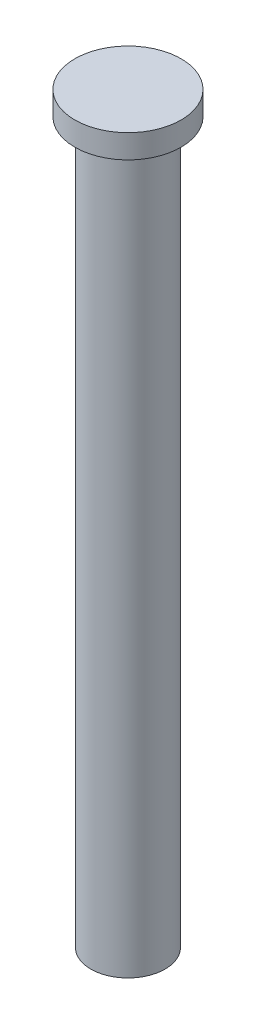
ISO-10303-21;
HEADER;
FILE_DESCRIPTION(('STEP AP214'),'2;1');
FILE_NAME('part.step','',(''),(''),'','','');
FILE_SCHEMA(('AUTOMOTIVE_DESIGN { 1 0 10303 214 1 1 1 1 }'));
ENDSEC;
DATA;
#1=APPLICATION_CONTEXT('core data for automotive mechanical design processes');
#2=APPLICATION_PROTOCOL_DEFINITION('international standard','automotive_design',2000,#1);
#3=PRODUCT_CONTEXT('',#1,'mechanical');
#4=PRODUCT('Part','Part','',(#3));
#5=PRODUCT_RELATED_PRODUCT_CATEGORY('part','',(#4));
#6=PRODUCT_DEFINITION_FORMATION('','',#4);
#7=PRODUCT_DEFINITION_CONTEXT('part definition',#1,'design');
#8=PRODUCT_DEFINITION('design','',#6,#7);
#9=PRODUCT_DEFINITION_SHAPE('','',#8);
#10=(LENGTH_UNIT() NAMED_UNIT(*) SI_UNIT(.MILLI.,.METRE.));
#11=(NAMED_UNIT(*) PLANE_ANGLE_UNIT() SI_UNIT($,.RADIAN.));
#12=(NAMED_UNIT(*) SI_UNIT($,.STERADIAN.) SOLID_ANGLE_UNIT());
#13=UNCERTAINTY_MEASURE_WITH_UNIT(LENGTH_MEASURE(1.E-05),#10,'distance_accuracy_value','');
#14=(GEOMETRIC_REPRESENTATION_CONTEXT(3) GLOBAL_UNCERTAINTY_ASSIGNED_CONTEXT((#13)) GLOBAL_UNIT_ASSIGNED_CONTEXT((#10,
#11,#12)) REPRESENTATION_CONTEXT('',''));
#15=CARTESIAN_POINT('',(0.,0.,0.));
#16=DIRECTION('',(0.,0.,1.));
#17=DIRECTION('',(1.,0.,0.));
#18=AXIS2_PLACEMENT_3D('',#15,#16,#17);
#19=CARTESIAN_POINT('',(0.,61.,0.));
#20=DIRECTION('',(0.,-1.,0.));
#21=DIRECTION('',(0.,0.,-1.));
#22=AXIS2_PLACEMENT_3D('',#19,#20,#21);
#23=CYLINDRICAL_SURFACE('',#22,3.15);
#24=CARTESIAN_POINT('',(0.,61.,0.));
#25=DIRECTION('',(0.,1.,0.));
#26=DIRECTION('',(0.,0.,1.));
#27=AXIS2_PLACEMENT_3D('',#24,#25,#26);
#28=CIRCLE('',#27,3.15);
#29=CARTESIAN_POINT('',(0.,61.,3.15));
#30=VERTEX_POINT('',#29);
#31=EDGE_CURVE('E10',#30,#30,#28,.T.);
#32=ORIENTED_EDGE('',*,*,#31,.F.);
#33=EDGE_LOOP('',(#32));
#34=FACE_BOUND('',#33,.T.);
#35=CARTESIAN_POINT('',(0.,0.,0.));
#36=DIRECTION('',(0.,1.,0.));
#37=DIRECTION('',(0.,0.,1.));
#38=AXIS2_PLACEMENT_3D('',#35,#36,#37);
#39=CIRCLE('',#38,3.15);
#40=CARTESIAN_POINT('',(0.,0.,3.15));
#41=VERTEX_POINT('',#40);
#42=EDGE_CURVE('E34',#41,#41,#39,.T.);
#43=ORIENTED_EDGE('',*,*,#42,.T.);
#44=EDGE_LOOP('',(#43));
#45=FACE_BOUND('',#44,.T.);
#46=ADVANCED_FACE('F31',(#34,#45),#23,.T.);
#47=CARTESIAN_POINT('',(0.,0.,0.));
#48=DIRECTION('',(0.,1.,0.));
#49=DIRECTION('',(0.,0.,1.));
#50=AXIS2_PLACEMENT_3D('',#47,#48,#49);
#51=PLANE('',#50);
#52=ORIENTED_EDGE('',*,*,#42,.F.);
#53=EDGE_LOOP('',(#52));
#54=FACE_BOUND('',#53,.T.);
#55=ADVANCED_FACE('F54',(#54),#51,.F.);
#56=CARTESIAN_POINT('',(0.,63.,0.));
#57=DIRECTION('',(0.,-1.,0.));
#58=DIRECTION('',(0.,0.,-1.));
#59=AXIS2_PLACEMENT_3D('',#56,#57,#58);
#60=CYLINDRICAL_SURFACE('',#59,4.5);
#61=CARTESIAN_POINT('',(0.,63.,0.));
#62=DIRECTION('',(0.,1.,0.));
#63=DIRECTION('',(0.,0.,1.));
#64=AXIS2_PLACEMENT_3D('',#61,#62,#63);
#65=CIRCLE('',#64,4.5);
#66=CARTESIAN_POINT('',(0.,63.,4.5));
#67=VERTEX_POINT('',#66);
#68=EDGE_CURVE('E41',#67,#67,#65,.T.);
#69=ORIENTED_EDGE('',*,*,#68,.F.);
#70=EDGE_LOOP('',(#69));
#71=FACE_BOUND('',#70,.T.);
#72=CARTESIAN_POINT('',(0.,61.,0.));
#73=DIRECTION('',(0.,1.,0.));
#74=DIRECTION('',(0.,0.,1.));
#75=AXIS2_PLACEMENT_3D('',#72,#73,#74);
#76=CIRCLE('',#75,4.5);
#77=CARTESIAN_POINT('',(0.,61.,4.5));
#78=VERTEX_POINT('',#77);
#79=EDGE_CURVE('E43',#78,#78,#76,.T.);
#80=ORIENTED_EDGE('',*,*,#79,.T.);
#81=EDGE_LOOP('',(#80));
#82=FACE_BOUND('',#81,.T.);
#83=ADVANCED_FACE('F51',(#71,#82),#60,.T.);
#84=CARTESIAN_POINT('',(0.,63.,0.));
#85=DIRECTION('',(0.,1.,0.));
#86=DIRECTION('',(0.,0.,1.));
#87=AXIS2_PLACEMENT_3D('',#84,#85,#86);
#88=PLANE('',#87);
#89=ORIENTED_EDGE('',*,*,#68,.T.);
#90=EDGE_LOOP('',(#89));
#91=FACE_BOUND('',#90,.T.);
#92=ADVANCED_FACE('F49',(#91),#88,.T.);
#93=CARTESIAN_POINT('',(0.,61.,0.));
#94=DIRECTION('',(0.,1.,0.));
#95=DIRECTION('',(0.,0.,1.));
#96=AXIS2_PLACEMENT_3D('',#93,#94,#95);
#97=PLANE('',#96);
#98=ORIENTED_EDGE('',*,*,#31,.T.);
#99=EDGE_LOOP('',(#98));
#100=FACE_BOUND('',#99,.T.);
#101=ORIENTED_EDGE('',*,*,#79,.F.);
#102=EDGE_LOOP('',(#101));
#103=FACE_BOUND('',#102,.T.);
#104=ADVANCED_FACE('F58',(#100,#103),#97,.F.);
#105=CLOSED_SHELL('',(#46,#55,#83,#92,#104));
#106=MANIFOLD_SOLID_BREP('B2',#105);
#107=ADVANCED_BREP_SHAPE_REPRESENTATION('',(#18,#106),#14);
#108=SHAPE_DEFINITION_REPRESENTATION(#9,#107);
ENDSEC;
END-ISO-10303-21;
